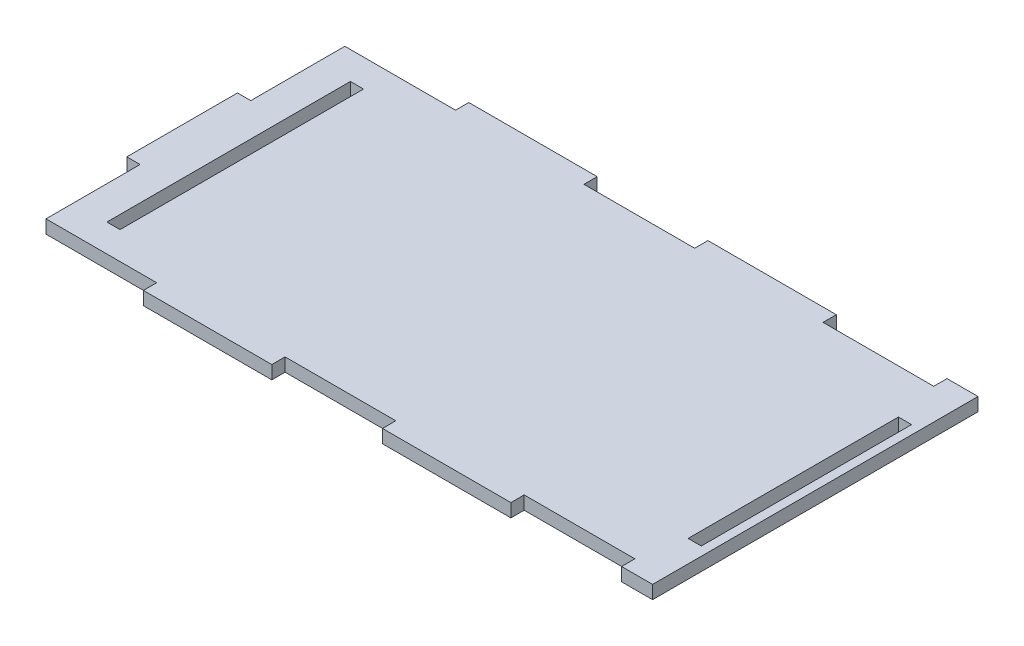
ISO-10303-21;
HEADER;
FILE_DESCRIPTION(('STEP AP214'),'2;1');
FILE_NAME('part.step','',(''),(''),'','','');
FILE_SCHEMA(('AUTOMOTIVE_DESIGN { 1 0 10303 214 1 1 1 1 }'));
ENDSEC;
DATA;
#1=APPLICATION_CONTEXT('core data for automotive mechanical design processes');
#2=APPLICATION_PROTOCOL_DEFINITION('international standard','automotive_design',2000,#1);
#3=PRODUCT_CONTEXT('',#1,'mechanical');
#4=PRODUCT('Part','Part','',(#3));
#5=PRODUCT_RELATED_PRODUCT_CATEGORY('part','',(#4));
#6=PRODUCT_DEFINITION_FORMATION('','',#4);
#7=PRODUCT_DEFINITION_CONTEXT('part definition',#1,'design');
#8=PRODUCT_DEFINITION('design','',#6,#7);
#9=PRODUCT_DEFINITION_SHAPE('','',#8);
#10=(LENGTH_UNIT() NAMED_UNIT(*) SI_UNIT(.MILLI.,.METRE.));
#11=(NAMED_UNIT(*) PLANE_ANGLE_UNIT() SI_UNIT($,.RADIAN.));
#12=(NAMED_UNIT(*) SI_UNIT($,.STERADIAN.) SOLID_ANGLE_UNIT());
#13=UNCERTAINTY_MEASURE_WITH_UNIT(LENGTH_MEASURE(1.E-05),#10,'distance_accuracy_value','');
#14=(GEOMETRIC_REPRESENTATION_CONTEXT(3) GLOBAL_UNCERTAINTY_ASSIGNED_CONTEXT((#13)) GLOBAL_UNIT_ASSIGNED_CONTEXT((#10,
#11,#12)) REPRESENTATION_CONTEXT('',''));
#15=CARTESIAN_POINT('',(0.,0.,0.));
#16=DIRECTION('',(0.,0.,1.));
#17=DIRECTION('',(1.,0.,0.));
#18=AXIS2_PLACEMENT_3D('',#15,#16,#17);
#19=CARTESIAN_POINT('',(-133.,6.,0.));
#20=DIRECTION('',(1.,0.,0.));
#21=DIRECTION('',(0.,0.,-1.));
#22=AXIS2_PLACEMENT_3D('',#19,#20,#21);
#23=PLANE('',#22);
#24=DIRECTION('',(0.,1.,0.));
#25=VECTOR('',#24,1.);
#26=CARTESIAN_POINT('',(-133.,0.,25.));
#27=LINE('',#26,#25);
#28=CARTESIAN_POINT('',(-133.,0.,25.));
#29=VERTEX_POINT('',#28);
#30=CARTESIAN_POINT('',(-133.,6.,25.));
#31=VERTEX_POINT('',#30);
#32=EDGE_CURVE('E424',#29,#31,#27,.T.);
#33=ORIENTED_EDGE('',*,*,#32,.F.);
#34=DIRECTION('',(0.,0.,1.));
#35=VECTOR('',#34,1.);
#36=CARTESIAN_POINT('',(-133.,0.,0.));
#37=LINE('',#36,#35);
#38=CARTESIAN_POINT('',(-133.,0.,67.5));
#39=VERTEX_POINT('',#38);
#40=EDGE_CURVE('E630',#29,#39,#37,.T.);
#41=ORIENTED_EDGE('',*,*,#40,.T.);
#42=DIRECTION('',(0.,-1.,0.));
#43=VECTOR('',#42,1.);
#44=CARTESIAN_POINT('',(-133.,6.,67.5));
#45=LINE('',#44,#43);
#46=CARTESIAN_POINT('',(-133.,6.,67.5));
#47=VERTEX_POINT('',#46);
#48=EDGE_CURVE('E813',#47,#39,#45,.T.);
#49=ORIENTED_EDGE('',*,*,#48,.F.);
#50=DIRECTION('',(0.,0.,1.));
#51=VECTOR('',#50,1.);
#52=CARTESIAN_POINT('',(-133.,6.,0.));
#53=LINE('',#52,#51);
#54=EDGE_CURVE('E532',#31,#47,#53,.T.);
#55=ORIENTED_EDGE('',*,*,#54,.F.);
#56=EDGE_LOOP('',(#33,#41,#49,#55));
#57=FACE_BOUND('',#56,.T.);
#58=ADVANCED_FACE('F40',(#57),#23,.F.);
#59=CARTESIAN_POINT('',(0.,6.,67.5));
#60=DIRECTION('',(0.,0.,-1.));
#61=DIRECTION('',(-1.,0.,0.));
#62=AXIS2_PLACEMENT_3D('',#59,#60,#61);
#63=PLANE('',#62);
#64=DIRECTION('',(1.,0.,0.));
#65=VECTOR('',#64,1.);
#66=CARTESIAN_POINT('',(0.,0.,67.5));
#67=LINE('',#66,#65);
#68=CARTESIAN_POINT('',(-25.,0.,67.5));
#69=VERTEX_POINT('',#68);
#70=CARTESIAN_POINT('',(25.,0.,67.5));
#71=VERTEX_POINT('',#70);
#72=EDGE_CURVE('E617',#69,#71,#67,.T.);
#73=ORIENTED_EDGE('',*,*,#72,.T.);
#74=DIRECTION('',(0.,1.,0.));
#75=VECTOR('',#74,1.);
#76=CARTESIAN_POINT('',(25.,0.,67.5));
#77=LINE('',#76,#75);
#78=CARTESIAN_POINT('',(25.,6.,67.5));
#79=VERTEX_POINT('',#78);
#80=EDGE_CURVE('E481',#71,#79,#77,.T.);
#81=ORIENTED_EDGE('',*,*,#80,.T.);
#82=DIRECTION('',(1.,0.,0.));
#83=VECTOR('',#82,1.);
#84=CARTESIAN_POINT('',(0.,6.,67.5));
#85=LINE('',#84,#83);
#86=CARTESIAN_POINT('',(-25.,6.,67.5));
#87=VERTEX_POINT('',#86);
#88=EDGE_CURVE('E462',#87,#79,#85,.T.);
#89=ORIENTED_EDGE('',*,*,#88,.F.);
#90=DIRECTION('',(0.,1.,0.));
#91=VECTOR('',#90,1.);
#92=CARTESIAN_POINT('',(-25.,0.,67.5));
#93=LINE('',#92,#91);
#94=EDGE_CURVE('E497',#69,#87,#93,.T.);
#95=ORIENTED_EDGE('',*,*,#94,.F.);
#96=EDGE_LOOP('',(#73,#81,#89,#95));
#97=FACE_BOUND('',#96,.T.);
#98=ADVANCED_FACE('F690',(#97),#63,.F.);
#99=CARTESIAN_POINT('',(83.0000000000001,6.,67.5));
#100=VERTEX_POINT('',#99);
#101=CARTESIAN_POINT('',(133.,6.,67.5));
#102=VERTEX_POINT('',#101);
#103=EDGE_CURVE('E463',#100,#102,#85,.T.);
#104=ORIENTED_EDGE('',*,*,#103,.F.);
#105=DIRECTION('',(0.,1.,0.));
#106=VECTOR('',#105,1.);
#107=CARTESIAN_POINT('',(83.0000000000001,0.,67.5));
#108=LINE('',#107,#106);
#109=CARTESIAN_POINT('',(83.0000000000001,0.,67.5));
#110=VERTEX_POINT('',#109);
#111=EDGE_CURVE('E826',#110,#100,#108,.T.);
#112=ORIENTED_EDGE('',*,*,#111,.F.);
#113=CARTESIAN_POINT('',(133.,0.,67.5));
#114=VERTEX_POINT('',#113);
#115=EDGE_CURVE('E619',#110,#114,#67,.T.);
#116=ORIENTED_EDGE('',*,*,#115,.T.);
#117=DIRECTION('',(0.,-1.,0.));
#118=VECTOR('',#117,1.);
#119=CARTESIAN_POINT('',(133.,6.,67.5));
#120=LINE('',#119,#118);
#121=EDGE_CURVE('E461',#102,#114,#120,.T.);
#122=ORIENTED_EDGE('',*,*,#121,.F.);
#123=EDGE_LOOP('',(#104,#112,#116,#122));
#124=FACE_BOUND('',#123,.T.);
#125=ADVANCED_FACE('F695',(#124),#63,.F.);
#126=CARTESIAN_POINT('',(0.,6.,-67.5));
#127=DIRECTION('',(0.,0.,-1.));
#128=DIRECTION('',(-1.,0.,0.));
#129=AXIS2_PLACEMENT_3D('',#126,#127,#128);
#130=PLANE('',#129);
#131=DIRECTION('',(0.,1.,0.));
#132=VECTOR('',#131,1.);
#133=CARTESIAN_POINT('',(25.,0.,-67.5));
#134=LINE('',#133,#132);
#135=CARTESIAN_POINT('',(25.,0.,-67.5));
#136=VERTEX_POINT('',#135);
#137=CARTESIAN_POINT('',(25.,6.,-67.5));
#138=VERTEX_POINT('',#137);
#139=EDGE_CURVE('E512',#136,#138,#134,.T.);
#140=ORIENTED_EDGE('',*,*,#139,.F.);
#141=DIRECTION('',(1.,0.,0.));
#142=VECTOR('',#141,1.);
#143=CARTESIAN_POINT('',(0.,0.,-67.5));
#144=LINE('',#143,#142);
#145=CARTESIAN_POINT('',(-25.,0.,-67.5));
#146=VERTEX_POINT('',#145);
#147=EDGE_CURVE('E638',#146,#136,#144,.T.);
#148=ORIENTED_EDGE('',*,*,#147,.F.);
#149=DIRECTION('',(0.,1.,0.));
#150=VECTOR('',#149,1.);
#151=CARTESIAN_POINT('',(-25.,0.,-67.5));
#152=LINE('',#151,#150);
#153=CARTESIAN_POINT('',(-25.,6.,-67.5));
#154=VERTEX_POINT('',#153);
#155=EDGE_CURVE('E564',#146,#154,#152,.T.);
#156=ORIENTED_EDGE('',*,*,#155,.T.);
#157=DIRECTION('',(1.,0.,0.));
#158=VECTOR('',#157,1.);
#159=CARTESIAN_POINT('',(0.,6.,-67.5));
#160=LINE('',#159,#158);
#161=EDGE_CURVE('E533',#154,#138,#160,.T.);
#162=ORIENTED_EDGE('',*,*,#161,.T.);
#163=EDGE_LOOP('',(#140,#148,#156,#162));
#164=FACE_BOUND('',#163,.T.);
#165=ADVANCED_FACE('F609',(#164),#130,.T.);
#166=DIRECTION('',(0.,1.,0.));
#167=VECTOR('',#166,1.);
#168=CARTESIAN_POINT('',(83.0000000000001,0.,-67.5));
#169=LINE('',#168,#167);
#170=CARTESIAN_POINT('',(83.0000000000001,0.,-67.5));
#171=VERTEX_POINT('',#170);
#172=CARTESIAN_POINT('',(83.0000000000001,6.,-67.5));
#173=VERTEX_POINT('',#172);
#174=EDGE_CURVE('E583',#171,#173,#169,.T.);
#175=ORIENTED_EDGE('',*,*,#174,.T.);
#176=CARTESIAN_POINT('',(133.,6.,-67.5));
#177=VERTEX_POINT('',#176);
#178=EDGE_CURVE('E534',#173,#177,#160,.T.);
#179=ORIENTED_EDGE('',*,*,#178,.T.);
#180=DIRECTION('',(0.,-1.,0.));
#181=VECTOR('',#180,1.);
#182=CARTESIAN_POINT('',(133.,6.,-67.5));
#183=LINE('',#182,#181);
#184=CARTESIAN_POINT('',(133.,0.,-67.5));
#185=VERTEX_POINT('',#184);
#186=EDGE_CURVE('E12',#177,#185,#183,.T.);
#187=ORIENTED_EDGE('',*,*,#186,.T.);
#188=EDGE_CURVE('E562',#171,#185,#144,.T.);
#189=ORIENTED_EDGE('',*,*,#188,.F.);
#190=EDGE_LOOP('',(#175,#179,#187,#189));
#191=FACE_BOUND('',#190,.T.);
#192=ADVANCED_FACE('F646',(#191),#130,.T.);
#193=DIRECTION('',(0.,1.,0.));
#194=VECTOR('',#193,1.);
#195=CARTESIAN_POINT('',(-82.9999999999999,0.,-67.5));
#196=LINE('',#195,#194);
#197=CARTESIAN_POINT('',(-82.9999999999999,0.,-67.5));
#198=VERTEX_POINT('',#197);
#199=CARTESIAN_POINT('',(-82.9999999999999,6.,-67.5));
#200=VERTEX_POINT('',#199);
#201=EDGE_CURVE('E535',#198,#200,#196,.T.);
#202=ORIENTED_EDGE('',*,*,#201,.F.);
#203=CARTESIAN_POINT('',(-133.,0.,-67.5));
#204=VERTEX_POINT('',#203);
#205=EDGE_CURVE('E467',#204,#198,#144,.T.);
#206=ORIENTED_EDGE('',*,*,#205,.F.);
#207=DIRECTION('',(0.,-1.,0.));
#208=VECTOR('',#207,1.);
#209=CARTESIAN_POINT('',(-133.,6.,-67.5));
#210=LINE('',#209,#208);
#211=CARTESIAN_POINT('',(-133.,6.,-67.5));
#212=VERTEX_POINT('',#211);
#213=EDGE_CURVE('E48',#212,#204,#210,.T.);
#214=ORIENTED_EDGE('',*,*,#213,.F.);
#215=EDGE_CURVE('E527',#212,#200,#160,.T.);
#216=ORIENTED_EDGE('',*,*,#215,.T.);
#217=EDGE_LOOP('',(#202,#206,#214,#216));
#218=FACE_BOUND('',#217,.T.);
#219=ADVANCED_FACE('F42',(#218),#130,.T.);
#220=CARTESIAN_POINT('',(-133.,0.,-25.));
#221=VERTEX_POINT('',#220);
#222=EDGE_CURVE('E624',#204,#221,#37,.T.);
#223=ORIENTED_EDGE('',*,*,#222,.T.);
#224=DIRECTION('',(0.,1.,0.));
#225=VECTOR('',#224,1.);
#226=CARTESIAN_POINT('',(-133.,0.,-25.));
#227=LINE('',#226,#225);
#228=CARTESIAN_POINT('',(-133.,6.,-25.));
#229=VERTEX_POINT('',#228);
#230=EDGE_CURVE('E404',#221,#229,#227,.T.);
#231=ORIENTED_EDGE('',*,*,#230,.T.);
#232=EDGE_CURVE('E464',#212,#229,#53,.T.);
#233=ORIENTED_EDGE('',*,*,#232,.F.);
#234=ORIENTED_EDGE('',*,*,#213,.T.);
#235=EDGE_LOOP('',(#223,#231,#233,#234));
#236=FACE_BOUND('',#235,.T.);
#237=ADVANCED_FACE('F691',(#236),#23,.F.);
#238=CARTESIAN_POINT('',(-82.9999999999999,0.,67.5));
#239=VERTEX_POINT('',#238);
#240=EDGE_CURVE('E612',#39,#239,#67,.T.);
#241=ORIENTED_EDGE('',*,*,#240,.T.);
#242=DIRECTION('',(0.,1.,0.));
#243=VECTOR('',#242,1.);
#244=CARTESIAN_POINT('',(-82.9999999999999,0.,67.5));
#245=LINE('',#244,#243);
#246=CARTESIAN_POINT('',(-82.9999999999999,6.,67.5));
#247=VERTEX_POINT('',#246);
#248=EDGE_CURVE('E493',#239,#247,#245,.T.);
#249=ORIENTED_EDGE('',*,*,#248,.T.);
#250=EDGE_CURVE('E456',#47,#247,#85,.T.);
#251=ORIENTED_EDGE('',*,*,#250,.F.);
#252=ORIENTED_EDGE('',*,*,#48,.T.);
#253=EDGE_LOOP('',(#241,#249,#251,#252));
#254=FACE_BOUND('',#253,.T.);
#255=ADVANCED_FACE('F698',(#254),#63,.F.);
#256=CARTESIAN_POINT('',(0.,6.,0.));
#257=DIRECTION('',(0.,1.,0.));
#258=DIRECTION('',(0.,0.,1.));
#259=AXIS2_PLACEMENT_3D('',#256,#257,#258);
#260=PLANE('',#259);
#261=DIRECTION('',(0.,0.,-1.));
#262=VECTOR('',#261,1.);
#263=CARTESIAN_POINT('',(143.,6.,47.5));
#264=LINE('',#263,#262);
#265=CARTESIAN_POINT('',(143.,6.,47.5));
#266=VERTEX_POINT('',#265);
#267=CARTESIAN_POINT('',(143.,6.,-47.5));
#268=VERTEX_POINT('',#267);
#269=EDGE_CURVE('E55',#266,#268,#264,.T.);
#270=ORIENTED_EDGE('',*,*,#269,.F.);
#271=DIRECTION('',(1.,0.,0.));
#272=VECTOR('',#271,1.);
#273=CARTESIAN_POINT('',(137.05,6.,47.5));
#274=LINE('',#273,#272);
#275=CARTESIAN_POINT('',(137.05,6.,47.5));
#276=VERTEX_POINT('',#275);
#277=EDGE_CURVE('E291',#276,#266,#274,.T.);
#278=ORIENTED_EDGE('',*,*,#277,.F.);
#279=DIRECTION('',(0.,0.,1.));
#280=VECTOR('',#279,1.);
#281=CARTESIAN_POINT('',(137.05,6.,47.5));
#282=LINE('',#281,#280);
#283=CARTESIAN_POINT('',(137.05,6.,-47.5));
#284=VERTEX_POINT('',#283);
#285=EDGE_CURVE('E295',#284,#276,#282,.T.);
#286=ORIENTED_EDGE('',*,*,#285,.F.);
#287=DIRECTION('',(-1.,0.,0.));
#288=VECTOR('',#287,1.);
#289=CARTESIAN_POINT('',(137.05,6.,-47.5));
#290=LINE('',#289,#288);
#291=EDGE_CURVE('E303',#268,#284,#290,.T.);
#292=ORIENTED_EDGE('',*,*,#291,.F.);
#293=EDGE_LOOP('',(#270,#278,#286,#292));
#294=FACE_BOUND('',#293,.T.);
#295=DIRECTION('',(0.,0.,-1.));
#296=VECTOR('',#295,1.);
#297=CARTESIAN_POINT('',(-112.05,6.,-55.));
#298=LINE('',#297,#296);
#299=CARTESIAN_POINT('',(-112.05,6.,55.));
#300=VERTEX_POINT('',#299);
#301=CARTESIAN_POINT('',(-112.05,6.,-55.));
#302=VERTEX_POINT('',#301);
#303=EDGE_CURVE('E354',#300,#302,#298,.T.);
#304=ORIENTED_EDGE('',*,*,#303,.F.);
#305=DIRECTION('',(1.,0.,0.));
#306=VECTOR('',#305,1.);
#307=CARTESIAN_POINT('',(-118.,6.,55.));
#308=LINE('',#307,#306);
#309=CARTESIAN_POINT('',(-118.,6.,55.));
#310=VERTEX_POINT('',#309);
#311=EDGE_CURVE('E359',#310,#300,#308,.T.);
#312=ORIENTED_EDGE('',*,*,#311,.F.);
#313=DIRECTION('',(0.,0.,1.));
#314=VECTOR('',#313,1.);
#315=CARTESIAN_POINT('',(-118.,6.,-55.));
#316=LINE('',#315,#314);
#317=CARTESIAN_POINT('',(-118.,6.,-55.));
#318=VERTEX_POINT('',#317);
#319=EDGE_CURVE('E384',#318,#310,#316,.T.);
#320=ORIENTED_EDGE('',*,*,#319,.F.);
#321=DIRECTION('',(-1.,0.,0.));
#322=VECTOR('',#321,1.);
#323=CARTESIAN_POINT('',(-118.,6.,-55.));
#324=LINE('',#323,#322);
#325=EDGE_CURVE('E372',#302,#318,#324,.T.);
#326=ORIENTED_EDGE('',*,*,#325,.F.);
#327=EDGE_LOOP('',(#304,#312,#320,#326));
#328=FACE_BOUND('',#327,.T.);
#329=ORIENTED_EDGE('',*,*,#103,.T.);
#330=DIRECTION('',(0.,0.,1.));
#331=VECTOR('',#330,1.);
#332=CARTESIAN_POINT('',(133.,6.,73.5));
#333=LINE('',#332,#331);
#334=CARTESIAN_POINT('',(133.,6.,73.5));
#335=VERTEX_POINT('',#334);
#336=EDGE_CURVE('E656',#102,#335,#333,.T.);
#337=ORIENTED_EDGE('',*,*,#336,.T.);
#338=DIRECTION('',(-1.,0.,0.));
#339=VECTOR('',#338,1.);
#340=CARTESIAN_POINT('',(147.,6.,73.5));
#341=LINE('',#340,#339);
#342=CARTESIAN_POINT('',(147.,6.,73.5));
#343=VERTEX_POINT('',#342);
#344=EDGE_CURVE('E331',#343,#335,#341,.T.);
#345=ORIENTED_EDGE('',*,*,#344,.F.);
#346=DIRECTION('',(0.,0.,1.));
#347=VECTOR('',#346,1.);
#348=CARTESIAN_POINT('',(147.,6.,73.5));
#349=LINE('',#348,#347);
#350=CARTESIAN_POINT('',(147.,6.,-73.5));
#351=VERTEX_POINT('',#350);
#352=EDGE_CURVE('E327',#351,#343,#349,.T.);
#353=ORIENTED_EDGE('',*,*,#352,.F.);
#354=DIRECTION('',(-1.,0.,0.));
#355=VECTOR('',#354,1.);
#356=CARTESIAN_POINT('',(147.,6.,-73.5));
#357=LINE('',#356,#355);
#358=CARTESIAN_POINT('',(133.,6.,-73.5));
#359=VERTEX_POINT('',#358);
#360=EDGE_CURVE('E342',#351,#359,#357,.T.);
#361=ORIENTED_EDGE('',*,*,#360,.T.);
#362=EDGE_CURVE('E323',#359,#177,#333,.T.);
#363=ORIENTED_EDGE('',*,*,#362,.T.);
#364=ORIENTED_EDGE('',*,*,#178,.F.);
#365=DIRECTION('',(0.,0.,-1.));
#366=VECTOR('',#365,1.);
#367=CARTESIAN_POINT('',(83.0000000000001,6.,-67.5));
#368=LINE('',#367,#366);
#369=CARTESIAN_POINT('',(83.0000000000001,6.,-73.5));
#370=VERTEX_POINT('',#369);
#371=EDGE_CURVE('E517',#173,#370,#368,.T.);
#372=ORIENTED_EDGE('',*,*,#371,.T.);
#373=DIRECTION('',(-1.,0.,0.));
#374=VECTOR('',#373,1.);
#375=CARTESIAN_POINT('',(25.,6.,-73.5));
#376=LINE('',#375,#374);
#377=CARTESIAN_POINT('',(25.,6.,-73.5));
#378=VERTEX_POINT('',#377);
#379=EDGE_CURVE('E506',#370,#378,#376,.T.);
#380=ORIENTED_EDGE('',*,*,#379,.T.);
#381=DIRECTION('',(0.,0.,1.));
#382=VECTOR('',#381,1.);
#383=CARTESIAN_POINT('',(25.,6.,-67.5));
#384=LINE('',#383,#382);
#385=EDGE_CURVE('E496',#378,#138,#384,.T.);
#386=ORIENTED_EDGE('',*,*,#385,.T.);
#387=ORIENTED_EDGE('',*,*,#161,.F.);
#388=DIRECTION('',(0.,0.,-1.));
#389=VECTOR('',#388,1.);
#390=CARTESIAN_POINT('',(-25.,6.,-67.5));
#391=LINE('',#390,#389);
#392=CARTESIAN_POINT('',(-25.,6.,-73.5));
#393=VERTEX_POINT('',#392);
#394=EDGE_CURVE('E547',#154,#393,#391,.T.);
#395=ORIENTED_EDGE('',*,*,#394,.T.);
#396=DIRECTION('',(-1.,0.,0.));
#397=VECTOR('',#396,1.);
#398=CARTESIAN_POINT('',(-82.9999999999999,6.,-73.5));
#399=LINE('',#398,#397);
#400=CARTESIAN_POINT('',(-82.9999999999999,6.,-73.5));
#401=VERTEX_POINT('',#400);
#402=EDGE_CURVE('E554',#393,#401,#399,.T.);
#403=ORIENTED_EDGE('',*,*,#402,.T.);
#404=DIRECTION('',(0.,0.,1.));
#405=VECTOR('',#404,1.);
#406=CARTESIAN_POINT('',(-82.9999999999999,6.,-67.5));
#407=LINE('',#406,#405);
#408=EDGE_CURVE('E542',#401,#200,#407,.T.);
#409=ORIENTED_EDGE('',*,*,#408,.T.);
#410=ORIENTED_EDGE('',*,*,#215,.F.);
#411=ORIENTED_EDGE('',*,*,#232,.T.);
#412=DIRECTION('',(-1.,0.,0.));
#413=VECTOR('',#412,1.);
#414=CARTESIAN_POINT('',(-133.,6.,-25.));
#415=LINE('',#414,#413);
#416=CARTESIAN_POINT('',(-139.,6.,-25.));
#417=VERTEX_POINT('',#416);
#418=EDGE_CURVE('E388',#229,#417,#415,.T.);
#419=ORIENTED_EDGE('',*,*,#418,.T.);
#420=DIRECTION('',(0.,0.,1.));
#421=VECTOR('',#420,1.);
#422=CARTESIAN_POINT('',(-139.,6.,-25.));
#423=LINE('',#422,#421);
#424=CARTESIAN_POINT('',(-139.,6.,25.));
#425=VERTEX_POINT('',#424);
#426=EDGE_CURVE('E409',#417,#425,#423,.T.);
#427=ORIENTED_EDGE('',*,*,#426,.T.);
#428=DIRECTION('',(1.,0.,0.));
#429=VECTOR('',#428,1.);
#430=CARTESIAN_POINT('',(-133.,6.,25.));
#431=LINE('',#430,#429);
#432=EDGE_CURVE('E399',#425,#31,#431,.T.);
#433=ORIENTED_EDGE('',*,*,#432,.T.);
#434=ORIENTED_EDGE('',*,*,#54,.T.);
#435=ORIENTED_EDGE('',*,*,#250,.T.);
#436=DIRECTION('',(0.,0.,1.));
#437=VECTOR('',#436,1.);
#438=CARTESIAN_POINT('',(-82.9999999999999,6.,67.5));
#439=LINE('',#438,#437);
#440=CARTESIAN_POINT('',(-82.9999999999999,6.,73.5));
#441=VERTEX_POINT('',#440);
#442=EDGE_CURVE('E475',#247,#441,#439,.T.);
#443=ORIENTED_EDGE('',*,*,#442,.T.);
#444=DIRECTION('',(1.,0.,0.));
#445=VECTOR('',#444,1.);
#446=CARTESIAN_POINT('',(-82.9999999999999,6.,73.5));
#447=LINE('',#446,#445);
#448=CARTESIAN_POINT('',(-25.,6.,73.5));
#449=VERTEX_POINT('',#448);
#450=EDGE_CURVE('E480',#441,#449,#447,.T.);
#451=ORIENTED_EDGE('',*,*,#450,.T.);
#452=DIRECTION('',(0.,0.,-1.));
#453=VECTOR('',#452,1.);
#454=CARTESIAN_POINT('',(-25.,6.,67.5));
#455=LINE('',#454,#453);
#456=EDGE_CURVE('E487',#449,#87,#455,.T.);
#457=ORIENTED_EDGE('',*,*,#456,.T.);
#458=ORIENTED_EDGE('',*,*,#88,.T.);
#459=DIRECTION('',(0.,0.,1.));
#460=VECTOR('',#459,1.);
#461=CARTESIAN_POINT('',(25.,6.,67.5));
#462=LINE('',#461,#460);
#463=CARTESIAN_POINT('',(25.,6.,73.5));
#464=VERTEX_POINT('',#463);
#465=EDGE_CURVE('E426',#79,#464,#462,.T.);
#466=ORIENTED_EDGE('',*,*,#465,.T.);
#467=DIRECTION('',(1.,0.,0.));
#468=VECTOR('',#467,1.);
#469=CARTESIAN_POINT('',(25.,6.,73.5));
#470=LINE('',#469,#468);
#471=CARTESIAN_POINT('',(83.0000000000001,6.,73.5));
#472=VERTEX_POINT('',#471);
#473=EDGE_CURVE('E448',#464,#472,#470,.T.);
#474=ORIENTED_EDGE('',*,*,#473,.T.);
#475=DIRECTION('',(0.,0.,-1.));
#476=VECTOR('',#475,1.);
#477=CARTESIAN_POINT('',(83.0000000000001,6.,67.5));
#478=LINE('',#477,#476);
#479=EDGE_CURVE('E437',#472,#100,#478,.T.);
#480=ORIENTED_EDGE('',*,*,#479,.T.);
#481=EDGE_LOOP('',(#329,#337,#345,#353,#361,#363,#364,#372,#380,#386,#387,#395,#403,#409,#410,
#411,#419,#427,#433,#434,#435,#443,#451,#457,#458,#466,#474,#480));
#482=FACE_BOUND('',#481,.T.);
#483=ADVANCED_FACE('F597',(#294,#328,#482),#260,.T.);
#484=CARTESIAN_POINT('',(0.,0.,0.));
#485=DIRECTION('',(0.,1.,0.));
#486=DIRECTION('',(0.,0.,1.));
#487=AXIS2_PLACEMENT_3D('',#484,#485,#486);
#488=PLANE('',#487);
#489=DIRECTION('',(1.,0.,0.));
#490=VECTOR('',#489,1.);
#491=CARTESIAN_POINT('',(137.05,0.,47.5));
#492=LINE('',#491,#490);
#493=CARTESIAN_POINT('',(137.05,0.,47.5));
#494=VERTEX_POINT('',#493);
#495=CARTESIAN_POINT('',(143.,0.,47.5));
#496=VERTEX_POINT('',#495);
#497=EDGE_CURVE('E281',#494,#496,#492,.T.);
#498=ORIENTED_EDGE('',*,*,#497,.T.);
#499=DIRECTION('',(0.,0.,-1.));
#500=VECTOR('',#499,1.);
#501=CARTESIAN_POINT('',(143.,0.,47.5));
#502=LINE('',#501,#500);
#503=CARTESIAN_POINT('',(143.,0.,-47.5));
#504=VERTEX_POINT('',#503);
#505=EDGE_CURVE('E275',#496,#504,#502,.T.);
#506=ORIENTED_EDGE('',*,*,#505,.T.);
#507=DIRECTION('',(-1.,0.,0.));
#508=VECTOR('',#507,1.);
#509=CARTESIAN_POINT('',(137.05,0.,-47.5));
#510=LINE('',#509,#508);
#511=CARTESIAN_POINT('',(137.05,0.,-47.5));
#512=VERTEX_POINT('',#511);
#513=EDGE_CURVE('E284',#504,#512,#510,.T.);
#514=ORIENTED_EDGE('',*,*,#513,.T.);
#515=DIRECTION('',(0.,0.,1.));
#516=VECTOR('',#515,1.);
#517=CARTESIAN_POINT('',(137.05,0.,47.5));
#518=LINE('',#517,#516);
#519=EDGE_CURVE('E63',#512,#494,#518,.T.);
#520=ORIENTED_EDGE('',*,*,#519,.T.);
#521=EDGE_LOOP('',(#498,#506,#514,#520));
#522=FACE_BOUND('',#521,.T.);
#523=DIRECTION('',(1.,0.,0.));
#524=VECTOR('',#523,1.);
#525=CARTESIAN_POINT('',(-118.,0.,55.));
#526=LINE('',#525,#524);
#527=CARTESIAN_POINT('',(-118.,0.,55.));
#528=VERTEX_POINT('',#527);
#529=CARTESIAN_POINT('',(-112.05,0.,55.));
#530=VERTEX_POINT('',#529);
#531=EDGE_CURVE('E365',#528,#530,#526,.T.);
#532=ORIENTED_EDGE('',*,*,#531,.T.);
#533=DIRECTION('',(0.,0.,-1.));
#534=VECTOR('',#533,1.);
#535=CARTESIAN_POINT('',(-112.05,0.,-55.));
#536=LINE('',#535,#534);
#537=CARTESIAN_POINT('',(-112.05,0.,-55.));
#538=VERTEX_POINT('',#537);
#539=EDGE_CURVE('E355',#530,#538,#536,.T.);
#540=ORIENTED_EDGE('',*,*,#539,.T.);
#541=DIRECTION('',(-1.,0.,0.));
#542=VECTOR('',#541,1.);
#543=CARTESIAN_POINT('',(-118.,0.,-55.));
#544=LINE('',#543,#542);
#545=CARTESIAN_POINT('',(-118.,0.,-55.));
#546=VERTEX_POINT('',#545);
#547=EDGE_CURVE('E358',#538,#546,#544,.T.);
#548=ORIENTED_EDGE('',*,*,#547,.T.);
#549=DIRECTION('',(0.,0.,1.));
#550=VECTOR('',#549,1.);
#551=CARTESIAN_POINT('',(-118.,0.,-55.));
#552=LINE('',#551,#550);
#553=EDGE_CURVE('E362',#546,#528,#552,.T.);
#554=ORIENTED_EDGE('',*,*,#553,.T.);
#555=EDGE_LOOP('',(#532,#540,#548,#554));
#556=FACE_BOUND('',#555,.T.);
#557=ORIENTED_EDGE('',*,*,#188,.T.);
#558=DIRECTION('',(0.,0.,-1.));
#559=VECTOR('',#558,1.);
#560=CARTESIAN_POINT('',(133.,0.,73.5));
#561=LINE('',#560,#559);
#562=CARTESIAN_POINT('',(133.,0.,-73.5));
#563=VERTEX_POINT('',#562);
#564=EDGE_CURVE('E645',#185,#563,#561,.T.);
#565=ORIENTED_EDGE('',*,*,#564,.T.);
#566=DIRECTION('',(-1.,0.,0.));
#567=VECTOR('',#566,1.);
#568=CARTESIAN_POINT('',(147.,0.,-73.5));
#569=LINE('',#568,#567);
#570=CARTESIAN_POINT('',(147.,0.,-73.5));
#571=VERTEX_POINT('',#570);
#572=EDGE_CURVE('E347',#571,#563,#569,.T.);
#573=ORIENTED_EDGE('',*,*,#572,.F.);
#574=DIRECTION('',(0.,0.,-1.));
#575=VECTOR('',#574,1.);
#576=CARTESIAN_POINT('',(147.,0.,73.5));
#577=LINE('',#576,#575);
#578=CARTESIAN_POINT('',(147.,0.,73.5));
#579=VERTEX_POINT('',#578);
#580=EDGE_CURVE('E322',#579,#571,#577,.T.);
#581=ORIENTED_EDGE('',*,*,#580,.F.);
#582=DIRECTION('',(-1.,0.,0.));
#583=VECTOR('',#582,1.);
#584=CARTESIAN_POINT('',(147.,0.,73.5));
#585=LINE('',#584,#583);
#586=CARTESIAN_POINT('',(133.,0.,73.5));
#587=VERTEX_POINT('',#586);
#588=EDGE_CURVE('E351',#579,#587,#585,.T.);
#589=ORIENTED_EDGE('',*,*,#588,.T.);
#590=EDGE_CURVE('E652',#587,#114,#561,.T.);
#591=ORIENTED_EDGE('',*,*,#590,.T.);
#592=ORIENTED_EDGE('',*,*,#115,.F.);
#593=DIRECTION('',(0.,0.,-1.));
#594=VECTOR('',#593,1.);
#595=CARTESIAN_POINT('',(83.0000000000001,0.,67.5));
#596=LINE('',#595,#594);
#597=CARTESIAN_POINT('',(83.0000000000001,0.,73.5));
#598=VERTEX_POINT('',#597);
#599=EDGE_CURVE('E440',#598,#110,#596,.T.);
#600=ORIENTED_EDGE('',*,*,#599,.F.);
#601=DIRECTION('',(1.,0.,0.));
#602=VECTOR('',#601,1.);
#603=CARTESIAN_POINT('',(25.,0.,73.5));
#604=LINE('',#603,#602);
#605=CARTESIAN_POINT('',(25.,0.,73.5));
#606=VERTEX_POINT('',#605);
#607=EDGE_CURVE('E436',#606,#598,#604,.T.);
#608=ORIENTED_EDGE('',*,*,#607,.F.);
#609=DIRECTION('',(0.,0.,1.));
#610=VECTOR('',#609,1.);
#611=CARTESIAN_POINT('',(25.,0.,67.5));
#612=LINE('',#611,#610);
#613=EDGE_CURVE('E433',#71,#606,#612,.T.);
#614=ORIENTED_EDGE('',*,*,#613,.F.);
#615=ORIENTED_EDGE('',*,*,#72,.F.);
#616=DIRECTION('',(0.,0.,-1.));
#617=VECTOR('',#616,1.);
#618=CARTESIAN_POINT('',(-25.,0.,67.5));
#619=LINE('',#618,#617);
#620=CARTESIAN_POINT('',(-25.,0.,73.5));
#621=VERTEX_POINT('',#620);
#622=EDGE_CURVE('E482',#621,#69,#619,.T.);
#623=ORIENTED_EDGE('',*,*,#622,.F.);
#624=DIRECTION('',(1.,0.,0.));
#625=VECTOR('',#624,1.);
#626=CARTESIAN_POINT('',(-82.9999999999999,0.,73.5));
#627=LINE('',#626,#625);
#628=CARTESIAN_POINT('',(-82.9999999999999,0.,73.5));
#629=VERTEX_POINT('',#628);
#630=EDGE_CURVE('E820',#629,#621,#627,.T.);
#631=ORIENTED_EDGE('',*,*,#630,.F.);
#632=DIRECTION('',(0.,0.,1.));
#633=VECTOR('',#632,1.);
#634=CARTESIAN_POINT('',(-82.9999999999999,0.,67.5));
#635=LINE('',#634,#633);
#636=EDGE_CURVE('E492',#239,#629,#635,.T.);
#637=ORIENTED_EDGE('',*,*,#636,.F.);
#638=ORIENTED_EDGE('',*,*,#240,.F.);
#639=ORIENTED_EDGE('',*,*,#40,.F.);
#640=DIRECTION('',(1.,0.,0.));
#641=VECTOR('',#640,1.);
#642=CARTESIAN_POINT('',(-133.,0.,25.));
#643=LINE('',#642,#641);
#644=CARTESIAN_POINT('',(-139.,0.,25.));
#645=VERTEX_POINT('',#644);
#646=EDGE_CURVE('E402',#645,#29,#643,.T.);
#647=ORIENTED_EDGE('',*,*,#646,.F.);
#648=DIRECTION('',(0.,0.,1.));
#649=VECTOR('',#648,1.);
#650=CARTESIAN_POINT('',(-139.,0.,-25.));
#651=LINE('',#650,#649);
#652=CARTESIAN_POINT('',(-139.,0.,-25.));
#653=VERTEX_POINT('',#652);
#654=EDGE_CURVE('E398',#653,#645,#651,.T.);
#655=ORIENTED_EDGE('',*,*,#654,.F.);
#656=DIRECTION('',(-1.,0.,0.));
#657=VECTOR('',#656,1.);
#658=CARTESIAN_POINT('',(-133.,0.,-25.));
#659=LINE('',#658,#657);
#660=EDGE_CURVE('E395',#221,#653,#659,.T.);
#661=ORIENTED_EDGE('',*,*,#660,.F.);
#662=ORIENTED_EDGE('',*,*,#222,.F.);
#663=ORIENTED_EDGE('',*,*,#205,.T.);
#664=DIRECTION('',(0.,0.,1.));
#665=VECTOR('',#664,1.);
#666=CARTESIAN_POINT('',(-82.9999999999999,0.,-67.5));
#667=LINE('',#666,#665);
#668=CARTESIAN_POINT('',(-82.9999999999999,0.,-73.5));
#669=VERTEX_POINT('',#668);
#670=EDGE_CURVE('E559',#669,#198,#667,.T.);
#671=ORIENTED_EDGE('',*,*,#670,.F.);
#672=DIRECTION('',(-1.,0.,0.));
#673=VECTOR('',#672,1.);
#674=CARTESIAN_POINT('',(-82.9999999999999,0.,-73.5));
#675=LINE('',#674,#673);
#676=CARTESIAN_POINT('',(-25.,0.,-73.5));
#677=VERTEX_POINT('',#676);
#678=EDGE_CURVE('E549',#677,#669,#675,.T.);
#679=ORIENTED_EDGE('',*,*,#678,.F.);
#680=DIRECTION('',(0.,0.,-1.));
#681=VECTOR('',#680,1.);
#682=CARTESIAN_POINT('',(-25.,0.,-67.5));
#683=LINE('',#682,#681);
#684=EDGE_CURVE('E574',#146,#677,#683,.T.);
#685=ORIENTED_EDGE('',*,*,#684,.F.);
#686=ORIENTED_EDGE('',*,*,#147,.T.);
#687=DIRECTION('',(0.,0.,1.));
#688=VECTOR('',#687,1.);
#689=CARTESIAN_POINT('',(25.,0.,-67.5));
#690=LINE('',#689,#688);
#691=CARTESIAN_POINT('',(25.,0.,-73.5));
#692=VERTEX_POINT('',#691);
#693=EDGE_CURVE('E503',#692,#136,#690,.T.);
#694=ORIENTED_EDGE('',*,*,#693,.F.);
#695=DIRECTION('',(-1.,0.,0.));
#696=VECTOR('',#695,1.);
#697=CARTESIAN_POINT('',(25.,0.,-73.5));
#698=LINE('',#697,#696);
#699=CARTESIAN_POINT('',(83.0000000000001,0.,-73.5));
#700=VERTEX_POINT('',#699);
#701=EDGE_CURVE('E509',#700,#692,#698,.T.);
#702=ORIENTED_EDGE('',*,*,#701,.F.);
#703=DIRECTION('',(0.,0.,-1.));
#704=VECTOR('',#703,1.);
#705=CARTESIAN_POINT('',(83.0000000000001,0.,-67.5));
#706=LINE('',#705,#704);
#707=EDGE_CURVE('E505',#171,#700,#706,.T.);
#708=ORIENTED_EDGE('',*,*,#707,.F.);
#709=EDGE_LOOP('',(#557,#565,#573,#581,#589,#591,#592,#600,#608,#614,#615,#623,#631,#637,#638,
#639,#647,#655,#661,#662,#663,#671,#679,#685,#686,#694,#702,#708));
#710=FACE_BOUND('',#709,.T.);
#711=ADVANCED_FACE('F288',(#522,#556,#710),#488,.F.);
#712=CARTESIAN_POINT('',(-82.9999999999999,0.,-67.5));
#713=DIRECTION('',(-1.,0.,0.));
#714=DIRECTION('',(0.,0.,1.));
#715=AXIS2_PLACEMENT_3D('',#712,#713,#714);
#716=PLANE('',#715);
#717=ORIENTED_EDGE('',*,*,#408,.F.);
#718=DIRECTION('',(0.,1.,0.));
#719=VECTOR('',#718,1.);
#720=CARTESIAN_POINT('',(-82.9999999999999,0.,-73.5));
#721=LINE('',#720,#719);
#722=EDGE_CURVE('E560',#669,#401,#721,.T.);
#723=ORIENTED_EDGE('',*,*,#722,.F.);
#724=ORIENTED_EDGE('',*,*,#670,.T.);
#725=ORIENTED_EDGE('',*,*,#201,.T.);
#726=EDGE_LOOP('',(#717,#723,#724,#725));
#727=FACE_BOUND('',#726,.T.);
#728=ADVANCED_FACE('F717',(#727),#716,.T.);
#729=CARTESIAN_POINT('',(-82.9999999999999,0.,-73.5));
#730=DIRECTION('',(0.,0.,-1.));
#731=DIRECTION('',(-1.,0.,0.));
#732=AXIS2_PLACEMENT_3D('',#729,#730,#731);
#733=PLANE('',#732);
#734=ORIENTED_EDGE('',*,*,#402,.F.);
#735=DIRECTION('',(0.,1.,0.));
#736=VECTOR('',#735,1.);
#737=CARTESIAN_POINT('',(-25.,0.,-73.5));
#738=LINE('',#737,#736);
#739=EDGE_CURVE('E563',#677,#393,#738,.T.);
#740=ORIENTED_EDGE('',*,*,#739,.F.);
#741=ORIENTED_EDGE('',*,*,#678,.T.);
#742=ORIENTED_EDGE('',*,*,#722,.T.);
#743=EDGE_LOOP('',(#734,#740,#741,#742));
#744=FACE_BOUND('',#743,.T.);
#745=ADVANCED_FACE('F723',(#744),#733,.T.);
#746=CARTESIAN_POINT('',(-25.,0.,-67.5));
#747=DIRECTION('',(1.,0.,0.));
#748=DIRECTION('',(0.,0.,-1.));
#749=AXIS2_PLACEMENT_3D('',#746,#747,#748);
#750=PLANE('',#749);
#751=ORIENTED_EDGE('',*,*,#394,.F.);
#752=ORIENTED_EDGE('',*,*,#155,.F.);
#753=ORIENTED_EDGE('',*,*,#684,.T.);
#754=ORIENTED_EDGE('',*,*,#739,.T.);
#755=EDGE_LOOP('',(#751,#752,#753,#754));
#756=FACE_BOUND('',#755,.T.);
#757=ADVANCED_FACE('F724',(#756),#750,.T.);
#758=CARTESIAN_POINT('',(25.,0.,-67.5));
#759=DIRECTION('',(-1.,0.,0.));
#760=DIRECTION('',(0.,0.,1.));
#761=AXIS2_PLACEMENT_3D('',#758,#759,#760);
#762=PLANE('',#761);
#763=ORIENTED_EDGE('',*,*,#385,.F.);
#764=DIRECTION('',(0.,1.,0.));
#765=VECTOR('',#764,1.);
#766=CARTESIAN_POINT('',(25.,0.,-73.5));
#767=LINE('',#766,#765);
#768=EDGE_CURVE('E548',#692,#378,#767,.T.);
#769=ORIENTED_EDGE('',*,*,#768,.F.);
#770=ORIENTED_EDGE('',*,*,#693,.T.);
#771=ORIENTED_EDGE('',*,*,#139,.T.);
#772=EDGE_LOOP('',(#763,#769,#770,#771));
#773=FACE_BOUND('',#772,.T.);
#774=ADVANCED_FACE('F607',(#773),#762,.T.);
#775=CARTESIAN_POINT('',(25.,0.,-73.5));
#776=DIRECTION('',(0.,0.,-1.));
#777=DIRECTION('',(-1.,0.,0.));
#778=AXIS2_PLACEMENT_3D('',#775,#776,#777);
#779=PLANE('',#778);
#780=ORIENTED_EDGE('',*,*,#379,.F.);
#781=DIRECTION('',(0.,1.,0.));
#782=VECTOR('',#781,1.);
#783=CARTESIAN_POINT('',(83.0000000000001,0.,-73.5));
#784=LINE('',#783,#782);
#785=EDGE_CURVE('E586',#700,#370,#784,.T.);
#786=ORIENTED_EDGE('',*,*,#785,.F.);
#787=ORIENTED_EDGE('',*,*,#701,.T.);
#788=ORIENTED_EDGE('',*,*,#768,.T.);
#789=EDGE_LOOP('',(#780,#786,#787,#788));
#790=FACE_BOUND('',#789,.T.);
#791=ADVANCED_FACE('F602',(#790),#779,.T.);
#792=CARTESIAN_POINT('',(83.0000000000001,0.,-67.5));
#793=DIRECTION('',(1.,0.,0.));
#794=DIRECTION('',(0.,0.,-1.));
#795=AXIS2_PLACEMENT_3D('',#792,#793,#794);
#796=PLANE('',#795);
#797=ORIENTED_EDGE('',*,*,#371,.F.);
#798=ORIENTED_EDGE('',*,*,#174,.F.);
#799=ORIENTED_EDGE('',*,*,#707,.T.);
#800=ORIENTED_EDGE('',*,*,#785,.T.);
#801=EDGE_LOOP('',(#797,#798,#799,#800));
#802=FACE_BOUND('',#801,.T.);
#803=ADVANCED_FACE('F731',(#802),#796,.T.);
#804=CARTESIAN_POINT('',(-82.9999999999999,0.,67.5));
#805=DIRECTION('',(-1.,0.,0.));
#806=DIRECTION('',(0.,0.,1.));
#807=AXIS2_PLACEMENT_3D('',#804,#805,#806);
#808=PLANE('',#807);
#809=ORIENTED_EDGE('',*,*,#442,.F.);
#810=ORIENTED_EDGE('',*,*,#248,.F.);
#811=ORIENTED_EDGE('',*,*,#636,.T.);
#812=DIRECTION('',(0.,1.,0.));
#813=VECTOR('',#812,1.);
#814=CARTESIAN_POINT('',(-82.9999999999999,0.,73.5));
#815=LINE('',#814,#813);
#816=EDGE_CURVE('E501',#629,#441,#815,.T.);
#817=ORIENTED_EDGE('',*,*,#816,.T.);
#818=EDGE_LOOP('',(#809,#810,#811,#817));
#819=FACE_BOUND('',#818,.T.);
#820=ADVANCED_FACE('F734',(#819),#808,.T.);
#821=CARTESIAN_POINT('',(-25.,0.,67.5));
#822=DIRECTION('',(1.,0.,0.));
#823=DIRECTION('',(0.,0.,-1.));
#824=AXIS2_PLACEMENT_3D('',#821,#822,#823);
#825=PLANE('',#824);
#826=ORIENTED_EDGE('',*,*,#456,.F.);
#827=DIRECTION('',(0.,1.,0.));
#828=VECTOR('',#827,1.);
#829=CARTESIAN_POINT('',(-25.,0.,73.5));
#830=LINE('',#829,#828);
#831=EDGE_CURVE('E499',#621,#449,#830,.T.);
#832=ORIENTED_EDGE('',*,*,#831,.F.);
#833=ORIENTED_EDGE('',*,*,#622,.T.);
#834=ORIENTED_EDGE('',*,*,#94,.T.);
#835=EDGE_LOOP('',(#826,#832,#833,#834));
#836=FACE_BOUND('',#835,.T.);
#837=ADVANCED_FACE('F739',(#836),#825,.T.);
#838=CARTESIAN_POINT('',(-82.9999999999999,0.,73.5));
#839=DIRECTION('',(0.,0.,1.));
#840=DIRECTION('',(1.,0.,0.));
#841=AXIS2_PLACEMENT_3D('',#838,#839,#840);
#842=PLANE('',#841);
#843=ORIENTED_EDGE('',*,*,#450,.F.);
#844=ORIENTED_EDGE('',*,*,#816,.F.);
#845=ORIENTED_EDGE('',*,*,#630,.T.);
#846=ORIENTED_EDGE('',*,*,#831,.T.);
#847=EDGE_LOOP('',(#843,#844,#845,#846));
#848=FACE_BOUND('',#847,.T.);
#849=ADVANCED_FACE('F741',(#848),#842,.T.);
#850=CARTESIAN_POINT('',(25.,0.,67.5));
#851=DIRECTION('',(-1.,0.,0.));
#852=DIRECTION('',(0.,0.,1.));
#853=AXIS2_PLACEMENT_3D('',#850,#851,#852);
#854=PLANE('',#853);
#855=ORIENTED_EDGE('',*,*,#465,.F.);
#856=ORIENTED_EDGE('',*,*,#80,.F.);
#857=ORIENTED_EDGE('',*,*,#613,.T.);
#858=DIRECTION('',(0.,1.,0.));
#859=VECTOR('',#858,1.);
#860=CARTESIAN_POINT('',(25.,0.,73.5));
#861=LINE('',#860,#859);
#862=EDGE_CURVE('E443',#606,#464,#861,.T.);
#863=ORIENTED_EDGE('',*,*,#862,.T.);
#864=EDGE_LOOP('',(#855,#856,#857,#863));
#865=FACE_BOUND('',#864,.T.);
#866=ADVANCED_FACE('F744',(#865),#854,.T.);
#867=CARTESIAN_POINT('',(83.0000000000001,0.,67.5));
#868=DIRECTION('',(1.,0.,0.));
#869=DIRECTION('',(0.,0.,-1.));
#870=AXIS2_PLACEMENT_3D('',#867,#868,#869);
#871=PLANE('',#870);
#872=ORIENTED_EDGE('',*,*,#479,.F.);
#873=DIRECTION('',(0.,1.,0.));
#874=VECTOR('',#873,1.);
#875=CARTESIAN_POINT('',(83.0000000000001,0.,73.5));
#876=LINE('',#875,#874);
#877=EDGE_CURVE('E824',#598,#472,#876,.T.);
#878=ORIENTED_EDGE('',*,*,#877,.F.);
#879=ORIENTED_EDGE('',*,*,#599,.T.);
#880=ORIENTED_EDGE('',*,*,#111,.T.);
#881=EDGE_LOOP('',(#872,#878,#879,#880));
#882=FACE_BOUND('',#881,.T.);
#883=ADVANCED_FACE('F751',(#882),#871,.T.);
#884=CARTESIAN_POINT('',(25.,0.,73.5));
#885=DIRECTION('',(0.,0.,1.));
#886=DIRECTION('',(1.,0.,0.));
#887=AXIS2_PLACEMENT_3D('',#884,#885,#886);
#888=PLANE('',#887);
#889=ORIENTED_EDGE('',*,*,#473,.F.);
#890=ORIENTED_EDGE('',*,*,#862,.F.);
#891=ORIENTED_EDGE('',*,*,#607,.T.);
#892=ORIENTED_EDGE('',*,*,#877,.T.);
#893=EDGE_LOOP('',(#889,#890,#891,#892));
#894=FACE_BOUND('',#893,.T.);
#895=ADVANCED_FACE('F753',(#894),#888,.T.);
#896=CARTESIAN_POINT('',(-133.,0.,25.));
#897=DIRECTION('',(0.,0.,1.));
#898=DIRECTION('',(1.,0.,0.));
#899=AXIS2_PLACEMENT_3D('',#896,#897,#898);
#900=PLANE('',#899);
#901=ORIENTED_EDGE('',*,*,#432,.F.);
#902=DIRECTION('',(0.,1.,0.));
#903=VECTOR('',#902,1.);
#904=CARTESIAN_POINT('',(-139.,0.,25.));
#905=LINE('',#904,#903);
#906=EDGE_CURVE('E427',#645,#425,#905,.T.);
#907=ORIENTED_EDGE('',*,*,#906,.F.);
#908=ORIENTED_EDGE('',*,*,#646,.T.);
#909=ORIENTED_EDGE('',*,*,#32,.T.);
#910=EDGE_LOOP('',(#901,#907,#908,#909));
#911=FACE_BOUND('',#910,.T.);
#912=ADVANCED_FACE('F756',(#911),#900,.T.);
#913=CARTESIAN_POINT('',(-139.,0.,-25.));
#914=DIRECTION('',(-1.,0.,0.));
#915=DIRECTION('',(0.,0.,1.));
#916=AXIS2_PLACEMENT_3D('',#913,#914,#915);
#917=PLANE('',#916);
#918=ORIENTED_EDGE('',*,*,#426,.F.);
#919=DIRECTION('',(0.,1.,0.));
#920=VECTOR('',#919,1.);
#921=CARTESIAN_POINT('',(-139.,0.,-25.));
#922=LINE('',#921,#920);
#923=EDGE_CURVE('E429',#653,#417,#922,.T.);
#924=ORIENTED_EDGE('',*,*,#923,.F.);
#925=ORIENTED_EDGE('',*,*,#654,.T.);
#926=ORIENTED_EDGE('',*,*,#906,.T.);
#927=EDGE_LOOP('',(#918,#924,#925,#926));
#928=FACE_BOUND('',#927,.T.);
#929=ADVANCED_FACE('F765',(#928),#917,.T.);
#930=CARTESIAN_POINT('',(-133.,0.,-25.));
#931=DIRECTION('',(0.,0.,-1.));
#932=DIRECTION('',(-1.,0.,0.));
#933=AXIS2_PLACEMENT_3D('',#930,#931,#932);
#934=PLANE('',#933);
#935=ORIENTED_EDGE('',*,*,#418,.F.);
#936=ORIENTED_EDGE('',*,*,#230,.F.);
#937=ORIENTED_EDGE('',*,*,#660,.T.);
#938=ORIENTED_EDGE('',*,*,#923,.T.);
#939=EDGE_LOOP('',(#935,#936,#937,#938));
#940=FACE_BOUND('',#939,.T.);
#941=ADVANCED_FACE('F761',(#940),#934,.T.);
#942=CARTESIAN_POINT('',(-112.05,0.,-55.));
#943=DIRECTION('',(1.,0.,0.));
#944=DIRECTION('',(0.,0.,-1.));
#945=AXIS2_PLACEMENT_3D('',#942,#943,#944);
#946=PLANE('',#945);
#947=ORIENTED_EDGE('',*,*,#303,.T.);
#948=DIRECTION('',(0.,1.,0.));
#949=VECTOR('',#948,1.);
#950=CARTESIAN_POINT('',(-112.05,0.,-55.));
#951=LINE('',#950,#949);
#952=EDGE_CURVE('E368',#538,#302,#951,.T.);
#953=ORIENTED_EDGE('',*,*,#952,.F.);
#954=ORIENTED_EDGE('',*,*,#539,.F.);
#955=DIRECTION('',(0.,1.,0.));
#956=VECTOR('',#955,1.);
#957=CARTESIAN_POINT('',(-112.05,0.,55.));
#958=LINE('',#957,#956);
#959=EDGE_CURVE('E386',#530,#300,#958,.T.);
#960=ORIENTED_EDGE('',*,*,#959,.T.);
#961=EDGE_LOOP('',(#947,#953,#954,#960));
#962=FACE_BOUND('',#961,.T.);
#963=ADVANCED_FACE('F764',(#962),#946,.F.);
#964=CARTESIAN_POINT('',(-118.,0.,55.));
#965=DIRECTION('',(0.,0.,1.));
#966=DIRECTION('',(1.,0.,0.));
#967=AXIS2_PLACEMENT_3D('',#964,#965,#966);
#968=PLANE('',#967);
#969=ORIENTED_EDGE('',*,*,#311,.T.);
#970=ORIENTED_EDGE('',*,*,#959,.F.);
#971=ORIENTED_EDGE('',*,*,#531,.F.);
#972=DIRECTION('',(0.,1.,0.));
#973=VECTOR('',#972,1.);
#974=CARTESIAN_POINT('',(-118.,0.,55.));
#975=LINE('',#974,#973);
#976=EDGE_CURVE('E389',#528,#310,#975,.T.);
#977=ORIENTED_EDGE('',*,*,#976,.T.);
#978=EDGE_LOOP('',(#969,#970,#971,#977));
#979=FACE_BOUND('',#978,.T.);
#980=ADVANCED_FACE('F775',(#979),#968,.F.);
#981=CARTESIAN_POINT('',(-118.,0.,-55.));
#982=DIRECTION('',(-1.,0.,0.));
#983=DIRECTION('',(0.,0.,1.));
#984=AXIS2_PLACEMENT_3D('',#981,#982,#983);
#985=PLANE('',#984);
#986=ORIENTED_EDGE('',*,*,#319,.T.);
#987=ORIENTED_EDGE('',*,*,#976,.F.);
#988=ORIENTED_EDGE('',*,*,#553,.F.);
#989=DIRECTION('',(0.,1.,0.));
#990=VECTOR('',#989,1.);
#991=CARTESIAN_POINT('',(-118.,0.,-55.));
#992=LINE('',#991,#990);
#993=EDGE_CURVE('E391',#546,#318,#992,.T.);
#994=ORIENTED_EDGE('',*,*,#993,.T.);
#995=EDGE_LOOP('',(#986,#987,#988,#994));
#996=FACE_BOUND('',#995,.T.);
#997=ADVANCED_FACE('F780',(#996),#985,.F.);
#998=CARTESIAN_POINT('',(-118.,0.,-55.));
#999=DIRECTION('',(0.,0.,-1.));
#1000=DIRECTION('',(-1.,0.,0.));
#1001=AXIS2_PLACEMENT_3D('',#998,#999,#1000);
#1002=PLANE('',#1001);
#1003=ORIENTED_EDGE('',*,*,#325,.T.);
#1004=ORIENTED_EDGE('',*,*,#993,.F.);
#1005=ORIENTED_EDGE('',*,*,#547,.F.);
#1006=ORIENTED_EDGE('',*,*,#952,.T.);
#1007=EDGE_LOOP('',(#1003,#1004,#1005,#1006));
#1008=FACE_BOUND('',#1007,.T.);
#1009=ADVANCED_FACE('F777',(#1008),#1002,.F.);
#1010=CARTESIAN_POINT('',(133.,0.,0.));
#1011=DIRECTION('',(1.,0.,0.));
#1012=DIRECTION('',(0.,0.,-1.));
#1013=AXIS2_PLACEMENT_3D('',#1010,#1011,#1012);
#1014=PLANE('',#1013);
#1015=ORIENTED_EDGE('',*,*,#336,.F.);
#1016=ORIENTED_EDGE('',*,*,#121,.T.);
#1017=ORIENTED_EDGE('',*,*,#590,.F.);
#1018=DIRECTION('',(0.,-1.,0.));
#1019=VECTOR('',#1018,1.);
#1020=CARTESIAN_POINT('',(133.,6.,73.5));
#1021=LINE('',#1020,#1019);
#1022=EDGE_CURVE('E315',#335,#587,#1021,.T.);
#1023=ORIENTED_EDGE('',*,*,#1022,.F.);
#1024=EDGE_LOOP('',(#1015,#1016,#1017,#1023));
#1025=FACE_BOUND('',#1024,.T.);
#1026=ADVANCED_FACE('F673',(#1025),#1014,.F.);
#1027=CARTESIAN_POINT('',(147.,6.,73.5));
#1028=DIRECTION('',(0.,0.,-1.));
#1029=DIRECTION('',(-1.,0.,0.));
#1030=AXIS2_PLACEMENT_3D('',#1027,#1028,#1029);
#1031=PLANE('',#1030);
#1032=ORIENTED_EDGE('',*,*,#1022,.T.);
#1033=ORIENTED_EDGE('',*,*,#588,.F.);
#1034=DIRECTION('',(0.,-1.,0.));
#1035=VECTOR('',#1034,1.);
#1036=CARTESIAN_POINT('',(147.,6.,73.5));
#1037=LINE('',#1036,#1035);
#1038=EDGE_CURVE('E319',#343,#579,#1037,.T.);
#1039=ORIENTED_EDGE('',*,*,#1038,.F.);
#1040=ORIENTED_EDGE('',*,*,#344,.T.);
#1041=EDGE_LOOP('',(#1032,#1033,#1039,#1040));
#1042=FACE_BOUND('',#1041,.T.);
#1043=ADVANCED_FACE('F671',(#1042),#1031,.F.);
#1044=CARTESIAN_POINT('',(147.,6.,-73.5));
#1045=DIRECTION('',(0.,0.,1.));
#1046=DIRECTION('',(1.,0.,0.));
#1047=AXIS2_PLACEMENT_3D('',#1044,#1045,#1046);
#1048=PLANE('',#1047);
#1049=DIRECTION('',(0.,1.,0.));
#1050=VECTOR('',#1049,1.);
#1051=CARTESIAN_POINT('',(133.,6.,-73.5));
#1052=LINE('',#1051,#1050);
#1053=EDGE_CURVE('E651',#563,#359,#1052,.T.);
#1054=ORIENTED_EDGE('',*,*,#1053,.T.);
#1055=ORIENTED_EDGE('',*,*,#360,.F.);
#1056=DIRECTION('',(0.,1.,0.));
#1057=VECTOR('',#1056,1.);
#1058=CARTESIAN_POINT('',(147.,6.,-73.5));
#1059=LINE('',#1058,#1057);
#1060=EDGE_CURVE('E325',#571,#351,#1059,.T.);
#1061=ORIENTED_EDGE('',*,*,#1060,.F.);
#1062=ORIENTED_EDGE('',*,*,#572,.T.);
#1063=EDGE_LOOP('',(#1054,#1055,#1061,#1062));
#1064=FACE_BOUND('',#1063,.T.);
#1065=ADVANCED_FACE('F679',(#1064),#1048,.F.);
#1066=CARTESIAN_POINT('',(147.,0.,0.));
#1067=DIRECTION('',(1.,0.,0.));
#1068=DIRECTION('',(0.,0.,-1.));
#1069=AXIS2_PLACEMENT_3D('',#1066,#1067,#1068);
#1070=PLANE('',#1069);
#1071=ORIENTED_EDGE('',*,*,#1038,.T.);
#1072=ORIENTED_EDGE('',*,*,#580,.T.);
#1073=ORIENTED_EDGE('',*,*,#1060,.T.);
#1074=ORIENTED_EDGE('',*,*,#352,.T.);
#1075=EDGE_LOOP('',(#1071,#1072,#1073,#1074));
#1076=FACE_BOUND('',#1075,.T.);
#1077=ADVANCED_FACE('F676',(#1076),#1070,.T.);
#1078=ORIENTED_EDGE('',*,*,#186,.F.);
#1079=ORIENTED_EDGE('',*,*,#362,.F.);
#1080=ORIENTED_EDGE('',*,*,#1053,.F.);
#1081=ORIENTED_EDGE('',*,*,#564,.F.);
#1082=EDGE_LOOP('',(#1078,#1079,#1080,#1081));
#1083=FACE_BOUND('',#1082,.T.);
#1084=ADVANCED_FACE('F650',(#1083),#1014,.F.);
#1085=CARTESIAN_POINT('',(143.,0.,47.5));
#1086=DIRECTION('',(1.,0.,0.));
#1087=DIRECTION('',(0.,0.,-1.));
#1088=AXIS2_PLACEMENT_3D('',#1085,#1086,#1087);
#1089=PLANE('',#1088);
#1090=ORIENTED_EDGE('',*,*,#269,.T.);
#1091=DIRECTION('',(0.,1.,0.));
#1092=VECTOR('',#1091,1.);
#1093=CARTESIAN_POINT('',(143.,0.,-47.5));
#1094=LINE('',#1093,#1092);
#1095=EDGE_CURVE('E271',#504,#268,#1094,.T.);
#1096=ORIENTED_EDGE('',*,*,#1095,.F.);
#1097=ORIENTED_EDGE('',*,*,#505,.F.);
#1098=DIRECTION('',(0.,1.,0.));
#1099=VECTOR('',#1098,1.);
#1100=CARTESIAN_POINT('',(143.,0.,47.5));
#1101=LINE('',#1100,#1099);
#1102=EDGE_CURVE('E313',#496,#266,#1101,.T.);
#1103=ORIENTED_EDGE('',*,*,#1102,.T.);
#1104=EDGE_LOOP('',(#1090,#1096,#1097,#1103));
#1105=FACE_BOUND('',#1104,.T.);
#1106=ADVANCED_FACE('F273',(#1105),#1089,.F.);
#1107=CARTESIAN_POINT('',(137.05,0.,47.5));
#1108=DIRECTION('',(0.,0.,1.));
#1109=DIRECTION('',(1.,0.,0.));
#1110=AXIS2_PLACEMENT_3D('',#1107,#1108,#1109);
#1111=PLANE('',#1110);
#1112=ORIENTED_EDGE('',*,*,#277,.T.);
#1113=ORIENTED_EDGE('',*,*,#1102,.F.);
#1114=ORIENTED_EDGE('',*,*,#497,.F.);
#1115=DIRECTION('',(0.,1.,0.));
#1116=VECTOR('',#1115,1.);
#1117=CARTESIAN_POINT('',(137.05,0.,47.5));
#1118=LINE('',#1117,#1116);
#1119=EDGE_CURVE('E316',#494,#276,#1118,.T.);
#1120=ORIENTED_EDGE('',*,*,#1119,.T.);
#1121=EDGE_LOOP('',(#1112,#1113,#1114,#1120));
#1122=FACE_BOUND('',#1121,.T.);
#1123=ADVANCED_FACE('F858',(#1122),#1111,.F.);
#1124=CARTESIAN_POINT('',(137.05,0.,47.5));
#1125=DIRECTION('',(-1.,0.,0.));
#1126=DIRECTION('',(0.,0.,1.));
#1127=AXIS2_PLACEMENT_3D('',#1124,#1125,#1126);
#1128=PLANE('',#1127);
#1129=ORIENTED_EDGE('',*,*,#285,.T.);
#1130=ORIENTED_EDGE('',*,*,#1119,.F.);
#1131=ORIENTED_EDGE('',*,*,#519,.F.);
#1132=DIRECTION('',(0.,1.,0.));
#1133=VECTOR('',#1132,1.);
#1134=CARTESIAN_POINT('',(137.05,0.,-47.5));
#1135=LINE('',#1134,#1133);
#1136=EDGE_CURVE('E280',#512,#284,#1135,.T.);
#1137=ORIENTED_EDGE('',*,*,#1136,.T.);
#1138=EDGE_LOOP('',(#1129,#1130,#1131,#1137));
#1139=FACE_BOUND('',#1138,.T.);
#1140=ADVANCED_FACE('F856',(#1139),#1128,.F.);
#1141=CARTESIAN_POINT('',(137.05,0.,-47.5));
#1142=DIRECTION('',(0.,0.,-1.));
#1143=DIRECTION('',(-1.,0.,0.));
#1144=AXIS2_PLACEMENT_3D('',#1141,#1142,#1143);
#1145=PLANE('',#1144);
#1146=ORIENTED_EDGE('',*,*,#291,.T.);
#1147=ORIENTED_EDGE('',*,*,#1136,.F.);
#1148=ORIENTED_EDGE('',*,*,#513,.F.);
#1149=ORIENTED_EDGE('',*,*,#1095,.T.);
#1150=EDGE_LOOP('',(#1146,#1147,#1148,#1149));
#1151=FACE_BOUND('',#1150,.T.);
#1152=ADVANCED_FACE('F285',(#1151),#1145,.F.);
#1153=CLOSED_SHELL('',(#58,#98,#125,#165,#192,#219,#237,#255,#483,#711,#728,#745,#757,#774,#791,
#803,#820,#837,#849,#866,#883,#895,#912,#929,#941,#963,#980,#997,#1009,#1026,#1043,#1065,#1077,
#1084,#1106,#1123,#1140,#1152));
#1154=MANIFOLD_SOLID_BREP('B2',#1153);
#1155=ADVANCED_BREP_SHAPE_REPRESENTATION('',(#18,#1154),#14);
#1156=SHAPE_DEFINITION_REPRESENTATION(#9,#1155);
ENDSEC;
END-ISO-10303-21;
